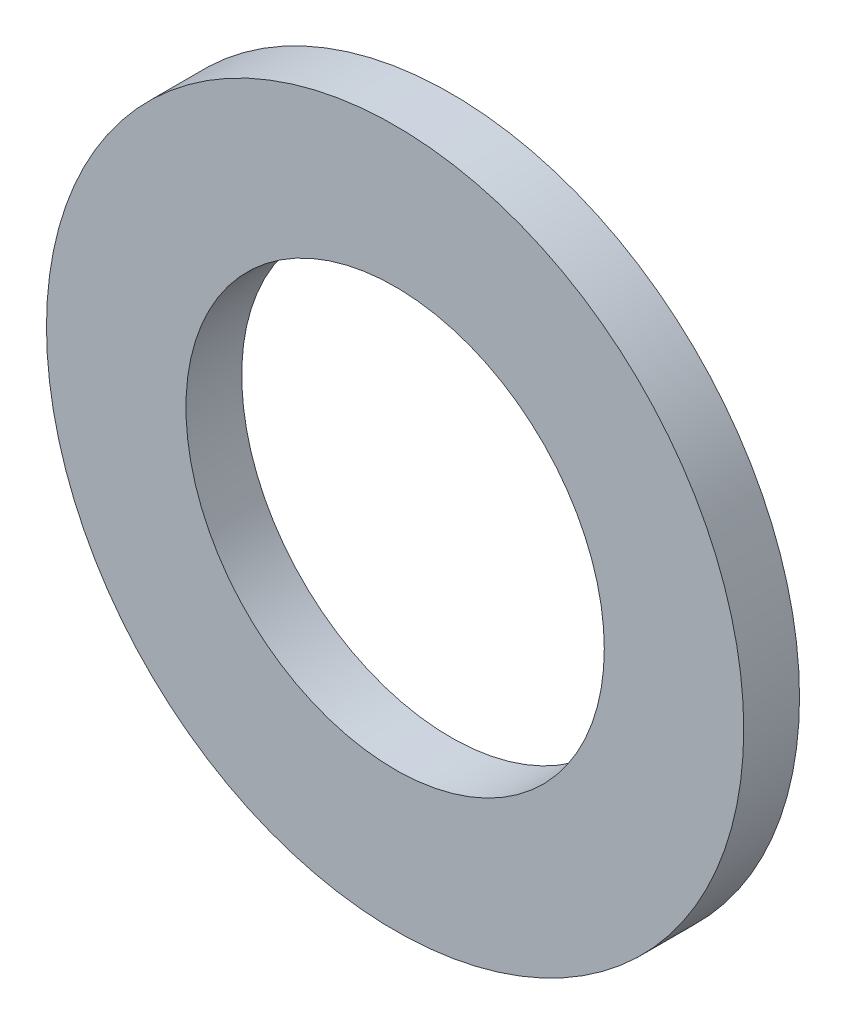
ISO-10303-21;
HEADER;
FILE_DESCRIPTION(('STEP AP214'),'2;1');
FILE_NAME('part.step','',(''),(''),'','','');
FILE_SCHEMA(('AUTOMOTIVE_DESIGN { 1 0 10303 214 1 1 1 1 }'));
ENDSEC;
DATA;
#1=APPLICATION_CONTEXT('core data for automotive mechanical design processes');
#2=APPLICATION_PROTOCOL_DEFINITION('international standard','automotive_design',2000,#1);
#3=PRODUCT_CONTEXT('',#1,'mechanical');
#4=PRODUCT('Part','Part','',(#3));
#5=PRODUCT_RELATED_PRODUCT_CATEGORY('part','',(#4));
#6=PRODUCT_DEFINITION_FORMATION('','',#4);
#7=PRODUCT_DEFINITION_CONTEXT('part definition',#1,'design');
#8=PRODUCT_DEFINITION('design','',#6,#7);
#9=PRODUCT_DEFINITION_SHAPE('','',#8);
#10=(LENGTH_UNIT() NAMED_UNIT(*) SI_UNIT(.MILLI.,.METRE.));
#11=(NAMED_UNIT(*) PLANE_ANGLE_UNIT() SI_UNIT($,.RADIAN.));
#12=(NAMED_UNIT(*) SI_UNIT($,.STERADIAN.) SOLID_ANGLE_UNIT());
#13=UNCERTAINTY_MEASURE_WITH_UNIT(LENGTH_MEASURE(1.E-05),#10,'distance_accuracy_value','');
#14=(GEOMETRIC_REPRESENTATION_CONTEXT(3) GLOBAL_UNCERTAINTY_ASSIGNED_CONTEXT((#13)) GLOBAL_UNIT_ASSIGNED_CONTEXT((#10,
#11,#12)) REPRESENTATION_CONTEXT('',''));
#15=CARTESIAN_POINT('',(0.,0.,0.));
#16=DIRECTION('',(0.,0.,1.));
#17=DIRECTION('',(1.,0.,0.));
#18=AXIS2_PLACEMENT_3D('',#15,#16,#17);
#19=CARTESIAN_POINT('',(0.,0.,0.4));
#20=DIRECTION('',(0.,0.,1.));
#21=DIRECTION('',(1.,0.,0.));
#22=AXIS2_PLACEMENT_3D('',#19,#20,#21);
#23=PLANE('',#22);
#24=CARTESIAN_POINT('',(0.,0.,0.4));
#25=DIRECTION('',(0.,0.,1.));
#26=DIRECTION('',(1.,0.,0.));
#27=AXIS2_PLACEMENT_3D('',#24,#25,#26);
#28=CIRCLE('',#27,2.5);
#29=CARTESIAN_POINT('',(2.5,0.,0.4));
#30=VERTEX_POINT('',#29);
#31=EDGE_CURVE('E10',#30,#30,#28,.T.);
#32=ORIENTED_EDGE('',*,*,#31,.T.);
#33=EDGE_LOOP('',(#32));
#34=FACE_BOUND('',#33,.T.);
#35=CARTESIAN_POINT('',(0.,0.,0.4));
#36=DIRECTION('',(0.,0.,1.));
#37=DIRECTION('',(1.,0.,0.));
#38=AXIS2_PLACEMENT_3D('',#35,#36,#37);
#39=CIRCLE('',#38,1.5);
#40=CARTESIAN_POINT('',(1.5,0.,0.4));
#41=VERTEX_POINT('',#40);
#42=EDGE_CURVE('E43',#41,#41,#39,.T.);
#43=ORIENTED_EDGE('',*,*,#42,.F.);
#44=EDGE_LOOP('',(#43));
#45=FACE_BOUND('',#44,.T.);
#46=ADVANCED_FACE('F32',(#34,#45),#23,.T.);
#47=CARTESIAN_POINT('',(0.,0.,0.));
#48=DIRECTION('',(0.,0.,1.));
#49=DIRECTION('',(1.,0.,0.));
#50=AXIS2_PLACEMENT_3D('',#47,#48,#49);
#51=PLANE('',#50);
#52=CARTESIAN_POINT('',(0.,0.,0.));
#53=DIRECTION('',(0.,0.,1.));
#54=DIRECTION('',(1.,0.,0.));
#55=AXIS2_PLACEMENT_3D('',#52,#53,#54);
#56=CIRCLE('',#55,2.5);
#57=CARTESIAN_POINT('',(2.5,0.,0.));
#58=VERTEX_POINT('',#57);
#59=EDGE_CURVE('E36',#58,#58,#56,.T.);
#60=ORIENTED_EDGE('',*,*,#59,.F.);
#61=EDGE_LOOP('',(#60));
#62=FACE_BOUND('',#61,.T.);
#63=CARTESIAN_POINT('',(0.,0.,0.));
#64=DIRECTION('',(0.,0.,1.));
#65=DIRECTION('',(1.,0.,0.));
#66=AXIS2_PLACEMENT_3D('',#63,#64,#65);
#67=CIRCLE('',#66,1.5);
#68=CARTESIAN_POINT('',(1.5,0.,0.));
#69=VERTEX_POINT('',#68);
#70=EDGE_CURVE('E45',#69,#69,#67,.T.);
#71=ORIENTED_EDGE('',*,*,#70,.T.);
#72=EDGE_LOOP('',(#71));
#73=FACE_BOUND('',#72,.T.);
#74=ADVANCED_FACE('F55',(#62,#73),#51,.F.);
#75=CARTESIAN_POINT('',(0.,0.,0.4));
#76=DIRECTION('',(0.,0.,-1.));
#77=DIRECTION('',(-1.,0.,0.));
#78=AXIS2_PLACEMENT_3D('',#75,#76,#77);
#79=CYLINDRICAL_SURFACE('',#78,2.5);
#80=ORIENTED_EDGE('',*,*,#31,.F.);
#81=EDGE_LOOP('',(#80));
#82=FACE_BOUND('',#81,.T.);
#83=ORIENTED_EDGE('',*,*,#59,.T.);
#84=EDGE_LOOP('',(#83));
#85=FACE_BOUND('',#84,.T.);
#86=ADVANCED_FACE('F34',(#82,#85),#79,.T.);
#87=CARTESIAN_POINT('',(0.,0.,0.4));
#88=DIRECTION('',(0.,0.,-1.));
#89=DIRECTION('',(-1.,0.,0.));
#90=AXIS2_PLACEMENT_3D('',#87,#88,#89);
#91=CYLINDRICAL_SURFACE('',#90,1.5);
#92=ORIENTED_EDGE('',*,*,#42,.T.);
#93=EDGE_LOOP('',(#92));
#94=FACE_BOUND('',#93,.T.);
#95=ORIENTED_EDGE('',*,*,#70,.F.);
#96=EDGE_LOOP('',(#95));
#97=FACE_BOUND('',#96,.T.);
#98=ADVANCED_FACE('F51',(#94,#97),#91,.F.);
#99=CLOSED_SHELL('',(#46,#74,#86,#98));
#100=MANIFOLD_SOLID_BREP('B2',#99);
#101=ADVANCED_BREP_SHAPE_REPRESENTATION('',(#18,#100),#14);
#102=SHAPE_DEFINITION_REPRESENTATION(#9,#101);
ENDSEC;
END-ISO-10303-21;
